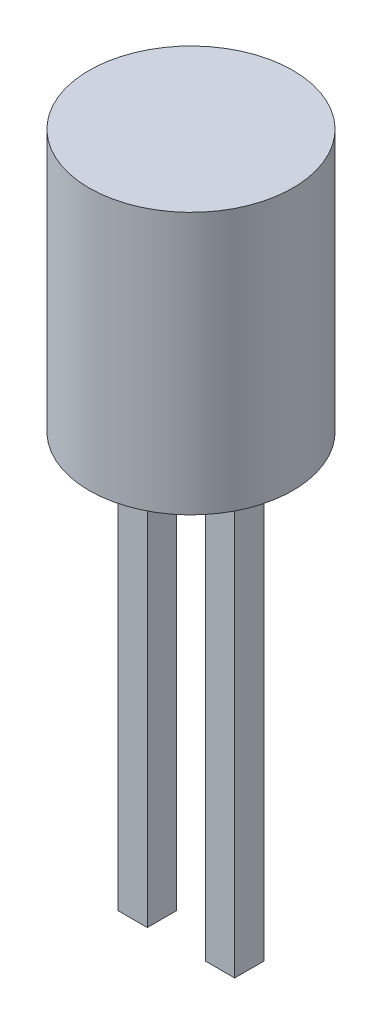
ISO-10303-21;
HEADER;
FILE_DESCRIPTION(('STEP AP214'),'2;1');
FILE_NAME('part.step','',(''),(''),'','','');
FILE_SCHEMA(('AUTOMOTIVE_DESIGN { 1 0 10303 214 1 1 1 1 }'));
ENDSEC;
DATA;
#1=APPLICATION_CONTEXT('core data for automotive mechanical design processes');
#2=APPLICATION_PROTOCOL_DEFINITION('international standard','automotive_design',2000,#1);
#3=PRODUCT_CONTEXT('',#1,'mechanical');
#4=PRODUCT('Part','Part','',(#3));
#5=PRODUCT_RELATED_PRODUCT_CATEGORY('part','',(#4));
#6=PRODUCT_DEFINITION_FORMATION('','',#4);
#7=PRODUCT_DEFINITION_CONTEXT('part definition',#1,'design');
#8=PRODUCT_DEFINITION('design','',#6,#7);
#9=PRODUCT_DEFINITION_SHAPE('','',#8);
#10=(LENGTH_UNIT() NAMED_UNIT(*) SI_UNIT(.MILLI.,.METRE.));
#11=(NAMED_UNIT(*) PLANE_ANGLE_UNIT() SI_UNIT($,.RADIAN.));
#12=(NAMED_UNIT(*) SI_UNIT($,.STERADIAN.) SOLID_ANGLE_UNIT());
#13=UNCERTAINTY_MEASURE_WITH_UNIT(LENGTH_MEASURE(1.E-05),#10,'distance_accuracy_value','');
#14=(GEOMETRIC_REPRESENTATION_CONTEXT(3) GLOBAL_UNCERTAINTY_ASSIGNED_CONTEXT((#13)) GLOBAL_UNIT_ASSIGNED_CONTEXT((#10,
#11,#12)) REPRESENTATION_CONTEXT('',''));
#15=CARTESIAN_POINT('',(0.,0.,0.));
#16=DIRECTION('',(0.,0.,1.));
#17=DIRECTION('',(1.,0.,0.));
#18=AXIS2_PLACEMENT_3D('',#15,#16,#17);
#19=CARTESIAN_POINT('',(0.,9.,0.));
#20=DIRECTION('',(0.,-1.,0.));
#21=DIRECTION('',(0.,0.,-1.));
#22=AXIS2_PLACEMENT_3D('',#19,#20,#21);
#23=CYLINDRICAL_SURFACE('',#22,3.5);
#24=CARTESIAN_POINT('',(0.,9.,0.));
#25=DIRECTION('',(0.,1.,0.));
#26=DIRECTION('',(0.,0.,1.));
#27=AXIS2_PLACEMENT_3D('',#24,#25,#26);
#28=CIRCLE('',#27,3.5);
#29=CARTESIAN_POINT('',(0.,9.,3.5));
#30=VERTEX_POINT('',#29);
#31=EDGE_CURVE('E149',#30,#30,#28,.T.);
#32=ORIENTED_EDGE('',*,*,#31,.F.);
#33=EDGE_LOOP('',(#32));
#34=FACE_BOUND('',#33,.T.);
#35=CARTESIAN_POINT('',(0.,0.,0.));
#36=DIRECTION('',(0.,1.,0.));
#37=DIRECTION('',(0.,0.,1.));
#38=AXIS2_PLACEMENT_3D('',#35,#36,#37);
#39=CIRCLE('',#38,3.5);
#40=CARTESIAN_POINT('',(0.,0.,3.5));
#41=VERTEX_POINT('',#40);
#42=EDGE_CURVE('E142',#41,#41,#39,.T.);
#43=ORIENTED_EDGE('',*,*,#42,.T.);
#44=EDGE_LOOP('',(#43));
#45=FACE_BOUND('',#44,.T.);
#46=ADVANCED_FACE('F33',(#34,#45),#23,.T.);
#47=CARTESIAN_POINT('',(0.,9.,0.));
#48=DIRECTION('',(0.,1.,0.));
#49=DIRECTION('',(0.,0.,1.));
#50=AXIS2_PLACEMENT_3D('',#47,#48,#49);
#51=PLANE('',#50);
#52=ORIENTED_EDGE('',*,*,#31,.T.);
#53=EDGE_LOOP('',(#52));
#54=FACE_BOUND('',#53,.T.);
#55=ADVANCED_FACE('F186',(#54),#51,.T.);
#56=CARTESIAN_POINT('',(0.,0.,0.));
#57=DIRECTION('',(0.,1.,0.));
#58=DIRECTION('',(0.,0.,1.));
#59=AXIS2_PLACEMENT_3D('',#56,#57,#58);
#60=PLANE('',#59);
#61=DIRECTION('',(-1.,0.,0.));
#62=VECTOR('',#61,1.);
#63=CARTESIAN_POINT('',(0.,0.,-0.5));
#64=LINE('',#63,#62);
#65=CARTESIAN_POINT('',(2.,0.,-0.5));
#66=VERTEX_POINT('',#65);
#67=CARTESIAN_POINT('',(1.,0.,-0.5));
#68=VERTEX_POINT('',#67);
#69=EDGE_CURVE('E40',#66,#68,#64,.T.);
#70=ORIENTED_EDGE('',*,*,#69,.T.);
#71=DIRECTION('',(0.,0.,1.));
#72=VECTOR('',#71,1.);
#73=CARTESIAN_POINT('',(1.,0.,0.));
#74=LINE('',#73,#72);
#75=CARTESIAN_POINT('',(1.,0.,0.5));
#76=VERTEX_POINT('',#75);
#77=EDGE_CURVE('E11',#68,#76,#74,.T.);
#78=ORIENTED_EDGE('',*,*,#77,.T.);
#79=DIRECTION('',(1.,0.,0.));
#80=VECTOR('',#79,1.);
#81=CARTESIAN_POINT('',(0.,0.,0.5));
#82=LINE('',#81,#80);
#83=CARTESIAN_POINT('',(2.,0.,0.5));
#84=VERTEX_POINT('',#83);
#85=EDGE_CURVE('E100',#76,#84,#82,.T.);
#86=ORIENTED_EDGE('',*,*,#85,.T.);
#87=DIRECTION('',(0.,0.,-1.));
#88=VECTOR('',#87,1.);
#89=CARTESIAN_POINT('',(2.,0.,0.));
#90=LINE('',#89,#88);
#91=EDGE_CURVE('E167',#84,#66,#90,.T.);
#92=ORIENTED_EDGE('',*,*,#91,.T.);
#93=EDGE_LOOP('',(#70,#78,#86,#92));
#94=FACE_BOUND('',#93,.T.);
#95=DIRECTION('',(-1.,0.,0.));
#96=VECTOR('',#95,1.);
#97=CARTESIAN_POINT('',(0.,0.,-0.5));
#98=LINE('',#97,#96);
#99=CARTESIAN_POINT('',(-1.,0.,-0.5));
#100=VERTEX_POINT('',#99);
#101=CARTESIAN_POINT('',(-2.,0.,-0.5));
#102=VERTEX_POINT('',#101);
#103=EDGE_CURVE('E160',#100,#102,#98,.T.);
#104=ORIENTED_EDGE('',*,*,#103,.T.);
#105=DIRECTION('',(0.,0.,1.));
#106=VECTOR('',#105,1.);
#107=CARTESIAN_POINT('',(-2.,0.,0.));
#108=LINE('',#107,#106);
#109=CARTESIAN_POINT('',(-2.,0.,0.5));
#110=VERTEX_POINT('',#109);
#111=EDGE_CURVE('E163',#102,#110,#108,.T.);
#112=ORIENTED_EDGE('',*,*,#111,.T.);
#113=DIRECTION('',(1.,0.,0.));
#114=VECTOR('',#113,1.);
#115=CARTESIAN_POINT('',(0.,0.,0.5));
#116=LINE('',#115,#114);
#117=CARTESIAN_POINT('',(-1.,0.,0.5));
#118=VERTEX_POINT('',#117);
#119=EDGE_CURVE('E152',#110,#118,#116,.T.);
#120=ORIENTED_EDGE('',*,*,#119,.T.);
#121=DIRECTION('',(0.,0.,-1.));
#122=VECTOR('',#121,1.);
#123=CARTESIAN_POINT('',(-1.,0.,0.));
#124=LINE('',#123,#122);
#125=EDGE_CURVE('E157',#118,#100,#124,.T.);
#126=ORIENTED_EDGE('',*,*,#125,.T.);
#127=EDGE_LOOP('',(#104,#112,#120,#126));
#128=FACE_BOUND('',#127,.T.);
#129=ORIENTED_EDGE('',*,*,#42,.F.);
#130=EDGE_LOOP('',(#129));
#131=FACE_BOUND('',#130,.T.);
#132=ADVANCED_FACE('F171',(#94,#128,#131),#60,.F.);
#133=CARTESIAN_POINT('',(-2.,-15.,-0.5));
#134=DIRECTION('',(-1.,0.,0.));
#135=DIRECTION('',(0.,0.,1.));
#136=AXIS2_PLACEMENT_3D('',#133,#134,#135);
#137=PLANE('',#136);
#138=ORIENTED_EDGE('',*,*,#111,.F.);
#139=DIRECTION('',(0.,1.,0.));
#140=VECTOR('',#139,1.);
#141=CARTESIAN_POINT('',(-2.,-15.,-0.5));
#142=LINE('',#141,#140);
#143=CARTESIAN_POINT('',(-2.,-15.,-0.5));
#144=VERTEX_POINT('',#143);
#145=EDGE_CURVE('E139',#144,#102,#142,.T.);
#146=ORIENTED_EDGE('',*,*,#145,.F.);
#147=DIRECTION('',(0.,0.,1.));
#148=VECTOR('',#147,1.);
#149=CARTESIAN_POINT('',(-2.,-15.,-0.5));
#150=LINE('',#149,#148);
#151=CARTESIAN_POINT('',(-2.,-15.,0.5));
#152=VERTEX_POINT('',#151);
#153=EDGE_CURVE('E123',#144,#152,#150,.T.);
#154=ORIENTED_EDGE('',*,*,#153,.T.);
#155=DIRECTION('',(0.,1.,0.));
#156=VECTOR('',#155,1.);
#157=CARTESIAN_POINT('',(-2.,-15.,0.5));
#158=LINE('',#157,#156);
#159=EDGE_CURVE('E138',#152,#110,#158,.T.);
#160=ORIENTED_EDGE('',*,*,#159,.T.);
#161=EDGE_LOOP('',(#138,#146,#154,#160));
#162=FACE_BOUND('',#161,.T.);
#163=ADVANCED_FACE('F198',(#162),#137,.T.);
#164=CARTESIAN_POINT('',(-2.,-15.,-0.5));
#165=DIRECTION('',(0.,0.,-1.));
#166=DIRECTION('',(-1.,0.,0.));
#167=AXIS2_PLACEMENT_3D('',#164,#165,#166);
#168=PLANE('',#167);
#169=ORIENTED_EDGE('',*,*,#103,.F.);
#170=DIRECTION('',(0.,1.,0.));
#171=VECTOR('',#170,1.);
#172=CARTESIAN_POINT('',(-1.,-15.,-0.5));
#173=LINE('',#172,#171);
#174=CARTESIAN_POINT('',(-1.,-15.,-0.5));
#175=VERTEX_POINT('',#174);
#176=EDGE_CURVE('E143',#175,#100,#173,.T.);
#177=ORIENTED_EDGE('',*,*,#176,.F.);
#178=DIRECTION('',(-1.,0.,0.));
#179=VECTOR('',#178,1.);
#180=CARTESIAN_POINT('',(-2.,-15.,-0.5));
#181=LINE('',#180,#179);
#182=EDGE_CURVE('E135',#175,#144,#181,.T.);
#183=ORIENTED_EDGE('',*,*,#182,.T.);
#184=ORIENTED_EDGE('',*,*,#145,.T.);
#185=EDGE_LOOP('',(#169,#177,#183,#184));
#186=FACE_BOUND('',#185,.T.);
#187=ADVANCED_FACE('F202',(#186),#168,.T.);
#188=CARTESIAN_POINT('',(-1.,-15.,-0.5));
#189=DIRECTION('',(1.,0.,0.));
#190=DIRECTION('',(0.,0.,-1.));
#191=AXIS2_PLACEMENT_3D('',#188,#189,#190);
#192=PLANE('',#191);
#193=ORIENTED_EDGE('',*,*,#125,.F.);
#194=DIRECTION('',(0.,1.,0.));
#195=VECTOR('',#194,1.);
#196=CARTESIAN_POINT('',(-1.,-15.,0.5));
#197=LINE('',#196,#195);
#198=CARTESIAN_POINT('',(-1.,-15.,0.5));
#199=VERTEX_POINT('',#198);
#200=EDGE_CURVE('E55',#199,#118,#197,.T.);
#201=ORIENTED_EDGE('',*,*,#200,.F.);
#202=DIRECTION('',(0.,0.,-1.));
#203=VECTOR('',#202,1.);
#204=CARTESIAN_POINT('',(-1.,-15.,-0.5));
#205=LINE('',#204,#203);
#206=EDGE_CURVE('E132',#199,#175,#205,.T.);
#207=ORIENTED_EDGE('',*,*,#206,.T.);
#208=ORIENTED_EDGE('',*,*,#176,.T.);
#209=EDGE_LOOP('',(#193,#201,#207,#208));
#210=FACE_BOUND('',#209,.T.);
#211=ADVANCED_FACE('F210',(#210),#192,.T.);
#212=CARTESIAN_POINT('',(-2.,-15.,0.5));
#213=DIRECTION('',(0.,0.,1.));
#214=DIRECTION('',(1.,0.,0.));
#215=AXIS2_PLACEMENT_3D('',#212,#213,#214);
#216=PLANE('',#215);
#217=ORIENTED_EDGE('',*,*,#119,.F.);
#218=ORIENTED_EDGE('',*,*,#159,.F.);
#219=DIRECTION('',(1.,0.,0.));
#220=VECTOR('',#219,1.);
#221=CARTESIAN_POINT('',(-2.,-15.,0.5));
#222=LINE('',#221,#220);
#223=EDGE_CURVE('E130',#152,#199,#222,.T.);
#224=ORIENTED_EDGE('',*,*,#223,.T.);
#225=ORIENTED_EDGE('',*,*,#200,.T.);
#226=EDGE_LOOP('',(#217,#218,#224,#225));
#227=FACE_BOUND('',#226,.T.);
#228=ADVANCED_FACE('F206',(#227),#216,.T.);
#229=CARTESIAN_POINT('',(0.,-15.,0.));
#230=DIRECTION('',(0.,1.,0.));
#231=DIRECTION('',(0.,0.,1.));
#232=AXIS2_PLACEMENT_3D('',#229,#230,#231);
#233=PLANE('',#232);
#234=ORIENTED_EDGE('',*,*,#153,.F.);
#235=ORIENTED_EDGE('',*,*,#182,.F.);
#236=ORIENTED_EDGE('',*,*,#206,.F.);
#237=ORIENTED_EDGE('',*,*,#223,.F.);
#238=EDGE_LOOP('',(#234,#235,#236,#237));
#239=FACE_BOUND('',#238,.T.);
#240=ADVANCED_FACE('F209',(#239),#233,.F.);
#241=CARTESIAN_POINT('',(1.,-15.,-0.5));
#242=DIRECTION('',(-1.,0.,0.));
#243=DIRECTION('',(0.,0.,1.));
#244=AXIS2_PLACEMENT_3D('',#241,#242,#243);
#245=PLANE('',#244);
#246=ORIENTED_EDGE('',*,*,#77,.F.);
#247=DIRECTION('',(0.,1.,0.));
#248=VECTOR('',#247,1.);
#249=CARTESIAN_POINT('',(1.,-15.,-0.5));
#250=LINE('',#249,#248);
#251=CARTESIAN_POINT('',(1.,-15.,-0.5));
#252=VERTEX_POINT('',#251);
#253=EDGE_CURVE('E117',#252,#68,#250,.T.);
#254=ORIENTED_EDGE('',*,*,#253,.F.);
#255=DIRECTION('',(0.,0.,1.));
#256=VECTOR('',#255,1.);
#257=CARTESIAN_POINT('',(1.,-15.,-0.5));
#258=LINE('',#257,#256);
#259=CARTESIAN_POINT('',(1.,-15.,0.5));
#260=VERTEX_POINT('',#259);
#261=EDGE_CURVE('E110',#252,#260,#258,.T.);
#262=ORIENTED_EDGE('',*,*,#261,.T.);
#263=DIRECTION('',(0.,1.,0.));
#264=VECTOR('',#263,1.);
#265=CARTESIAN_POINT('',(1.,-15.,0.5));
#266=LINE('',#265,#264);
#267=EDGE_CURVE('E95',#260,#76,#266,.T.);
#268=ORIENTED_EDGE('',*,*,#267,.T.);
#269=EDGE_LOOP('',(#246,#254,#262,#268));
#270=FACE_BOUND('',#269,.T.);
#271=ADVANCED_FACE('F115',(#270),#245,.T.);
#272=CARTESIAN_POINT('',(1.,-15.,-0.5));
#273=DIRECTION('',(0.,0.,-1.));
#274=DIRECTION('',(-1.,0.,0.));
#275=AXIS2_PLACEMENT_3D('',#272,#273,#274);
#276=PLANE('',#275);
#277=ORIENTED_EDGE('',*,*,#69,.F.);
#278=DIRECTION('',(0.,1.,0.));
#279=VECTOR('',#278,1.);
#280=CARTESIAN_POINT('',(2.,-15.,-0.5));
#281=LINE('',#280,#279);
#282=CARTESIAN_POINT('',(2.,-15.,-0.5));
#283=VERTEX_POINT('',#282);
#284=EDGE_CURVE('E124',#283,#66,#281,.T.);
#285=ORIENTED_EDGE('',*,*,#284,.F.);
#286=DIRECTION('',(-1.,0.,0.));
#287=VECTOR('',#286,1.);
#288=CARTESIAN_POINT('',(1.,-15.,-0.5));
#289=LINE('',#288,#287);
#290=EDGE_CURVE('E103',#283,#252,#289,.T.);
#291=ORIENTED_EDGE('',*,*,#290,.T.);
#292=ORIENTED_EDGE('',*,*,#253,.T.);
#293=EDGE_LOOP('',(#277,#285,#291,#292));
#294=FACE_BOUND('',#293,.T.);
#295=ADVANCED_FACE('F174',(#294),#276,.T.);
#296=CARTESIAN_POINT('',(2.,-15.,-0.5));
#297=DIRECTION('',(1.,0.,0.));
#298=DIRECTION('',(0.,0.,-1.));
#299=AXIS2_PLACEMENT_3D('',#296,#297,#298);
#300=PLANE('',#299);
#301=ORIENTED_EDGE('',*,*,#91,.F.);
#302=DIRECTION('',(0.,1.,0.));
#303=VECTOR('',#302,1.);
#304=CARTESIAN_POINT('',(2.,-15.,0.5));
#305=LINE('',#304,#303);
#306=CARTESIAN_POINT('',(2.,-15.,0.5));
#307=VERTEX_POINT('',#306);
#308=EDGE_CURVE('E47',#307,#84,#305,.T.);
#309=ORIENTED_EDGE('',*,*,#308,.F.);
#310=DIRECTION('',(0.,0.,-1.));
#311=VECTOR('',#310,1.);
#312=CARTESIAN_POINT('',(2.,-15.,-0.5));
#313=LINE('',#312,#311);
#314=EDGE_CURVE('E113',#307,#283,#313,.T.);
#315=ORIENTED_EDGE('',*,*,#314,.T.);
#316=ORIENTED_EDGE('',*,*,#284,.T.);
#317=EDGE_LOOP('',(#301,#309,#315,#316));
#318=FACE_BOUND('',#317,.T.);
#319=ADVANCED_FACE('F176',(#318),#300,.T.);
#320=CARTESIAN_POINT('',(1.,-15.,0.5));
#321=DIRECTION('',(0.,0.,1.));
#322=DIRECTION('',(1.,0.,0.));
#323=AXIS2_PLACEMENT_3D('',#320,#321,#322);
#324=PLANE('',#323);
#325=ORIENTED_EDGE('',*,*,#85,.F.);
#326=ORIENTED_EDGE('',*,*,#267,.F.);
#327=DIRECTION('',(1.,0.,0.));
#328=VECTOR('',#327,1.);
#329=CARTESIAN_POINT('',(1.,-15.,0.5));
#330=LINE('',#329,#328);
#331=EDGE_CURVE('E98',#260,#307,#330,.T.);
#332=ORIENTED_EDGE('',*,*,#331,.T.);
#333=ORIENTED_EDGE('',*,*,#308,.T.);
#334=EDGE_LOOP('',(#325,#326,#332,#333));
#335=FACE_BOUND('',#334,.T.);
#336=ADVANCED_FACE('F97',(#335),#324,.T.);
#337=CARTESIAN_POINT('',(0.,-15.,0.));
#338=DIRECTION('',(0.,1.,0.));
#339=DIRECTION('',(0.,0.,1.));
#340=AXIS2_PLACEMENT_3D('',#337,#338,#339);
#341=PLANE('',#340);
#342=ORIENTED_EDGE('',*,*,#261,.F.);
#343=ORIENTED_EDGE('',*,*,#290,.F.);
#344=ORIENTED_EDGE('',*,*,#314,.F.);
#345=ORIENTED_EDGE('',*,*,#331,.F.);
#346=EDGE_LOOP('',(#342,#343,#344,#345));
#347=FACE_BOUND('',#346,.T.);
#348=ADVANCED_FACE('F108',(#347),#341,.F.);
#349=CLOSED_SHELL('',(#46,#55,#132,#163,#187,#211,#228,#240,#271,#295,#319,#336,#348));
#350=MANIFOLD_SOLID_BREP('B2',#349);
#351=ADVANCED_BREP_SHAPE_REPRESENTATION('',(#18,#350),#14);
#352=SHAPE_DEFINITION_REPRESENTATION(#9,#351);
ENDSEC;
END-ISO-10303-21;
